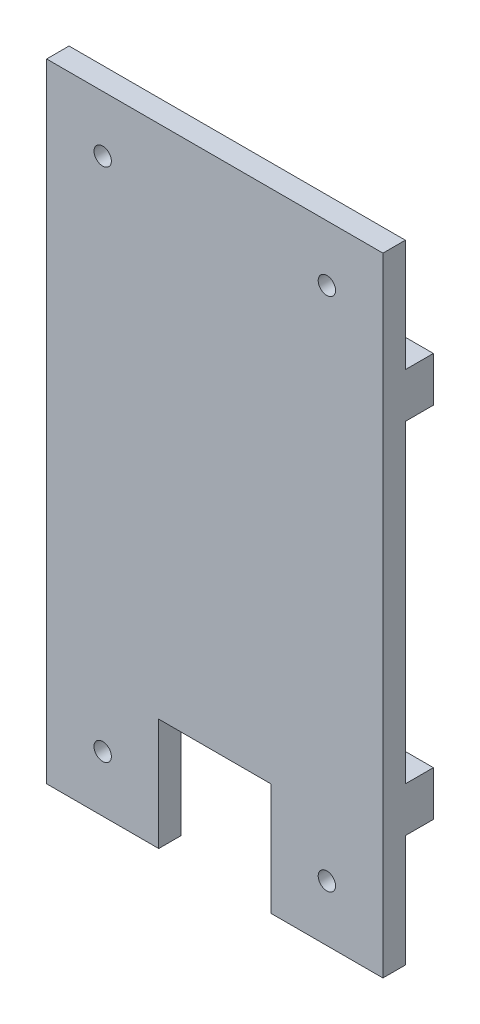
ISO-10303-21;
HEADER;
FILE_DESCRIPTION(('STEP AP214'),'2;1');
FILE_NAME('part.step','',(''),(''),'','','');
FILE_SCHEMA(('AUTOMOTIVE_DESIGN { 1 0 10303 214 1 1 1 1 }'));
ENDSEC;
DATA;
#1=APPLICATION_CONTEXT('core data for automotive mechanical design processes');
#2=APPLICATION_PROTOCOL_DEFINITION('international standard','automotive_design',2000,#1);
#3=PRODUCT_CONTEXT('',#1,'mechanical');
#4=PRODUCT('Part','Part','',(#3));
#5=PRODUCT_RELATED_PRODUCT_CATEGORY('part','',(#4));
#6=PRODUCT_DEFINITION_FORMATION('','',#4);
#7=PRODUCT_DEFINITION_CONTEXT('part definition',#1,'design');
#8=PRODUCT_DEFINITION('design','',#6,#7);
#9=PRODUCT_DEFINITION_SHAPE('','',#8);
#10=(LENGTH_UNIT() NAMED_UNIT(*) SI_UNIT(.MILLI.,.METRE.));
#11=(NAMED_UNIT(*) PLANE_ANGLE_UNIT() SI_UNIT($,.RADIAN.));
#12=(NAMED_UNIT(*) SI_UNIT($,.STERADIAN.) SOLID_ANGLE_UNIT());
#13=UNCERTAINTY_MEASURE_WITH_UNIT(LENGTH_MEASURE(1.E-05),#10,'distance_accuracy_value','');
#14=(GEOMETRIC_REPRESENTATION_CONTEXT(3) GLOBAL_UNCERTAINTY_ASSIGNED_CONTEXT((#13)) GLOBAL_UNIT_ASSIGNED_CONTEXT((#10,
#11,#12)) REPRESENTATION_CONTEXT('',''));
#15=CARTESIAN_POINT('',(0.,0.,0.));
#16=DIRECTION('',(0.,0.,1.));
#17=DIRECTION('',(1.,0.,0.));
#18=AXIS2_PLACEMENT_3D('',#15,#16,#17);
#19=CARTESIAN_POINT('',(0.,0.,0.));
#20=DIRECTION('',(0.,0.,1.));
#21=DIRECTION('',(1.,0.,0.));
#22=AXIS2_PLACEMENT_3D('',#19,#20,#21);
#23=PLANE('',#22);
#24=CARTESIAN_POINT('',(20.,-46.,0.));
#25=DIRECTION('',(0.,0.,1.));
#26=DIRECTION('',(1.,0.,0.));
#27=AXIS2_PLACEMENT_3D('',#24,#25,#26);
#28=CIRCLE('',#27,1.55);
#29=CARTESIAN_POINT('',(21.55,-46.,0.));
#30=VERTEX_POINT('',#29);
#31=EDGE_CURVE('E246',#30,#30,#28,.T.);
#32=ORIENTED_EDGE('',*,*,#31,.T.);
#33=EDGE_LOOP('',(#32));
#34=FACE_BOUND('',#33,.T.);
#35=DIRECTION('',(-1.,0.,0.));
#36=VECTOR('',#35,1.);
#37=CARTESIAN_POINT('',(0.,-36.,0.));
#38=LINE('',#37,#36);
#39=CARTESIAN_POINT('',(30.,-36.,0.));
#40=VERTEX_POINT('',#39);
#41=CARTESIAN_POINT('',(10.,-36.,0.));
#42=VERTEX_POINT('',#41);
#43=EDGE_CURVE('E167',#40,#42,#38,.T.);
#44=ORIENTED_EDGE('',*,*,#43,.F.);
#45=DIRECTION('',(0.,1.,0.));
#46=VECTOR('',#45,1.);
#47=CARTESIAN_POINT('',(30.,0.,0.));
#48=LINE('',#47,#46);
#49=CARTESIAN_POINT('',(30.,-56.,0.));
#50=VERTEX_POINT('',#49);
#51=EDGE_CURVE('E259',#50,#40,#48,.T.);
#52=ORIENTED_EDGE('',*,*,#51,.F.);
#53=DIRECTION('',(1.,0.,0.));
#54=VECTOR('',#53,1.);
#55=CARTESIAN_POINT('',(0.,-56.,0.));
#56=LINE('',#55,#54);
#57=CARTESIAN_POINT('',(10.,-56.,0.));
#58=VERTEX_POINT('',#57);
#59=EDGE_CURVE('E255',#58,#50,#56,.T.);
#60=ORIENTED_EDGE('',*,*,#59,.F.);
#61=DIRECTION('',(0.,1.,0.));
#62=VECTOR('',#61,1.);
#63=CARTESIAN_POINT('',(10.,0.,0.));
#64=LINE('',#63,#62);
#65=EDGE_CURVE('E252',#58,#42,#64,.T.);
#66=ORIENTED_EDGE('',*,*,#65,.T.);
#67=EDGE_LOOP('',(#44,#52,#60,#66));
#68=FACE_BOUND('',#67,.T.);
#69=ADVANCED_FACE('F32',(#34,#68),#23,.F.);
#70=CARTESIAN_POINT('',(-20.,-46.,0.));
#71=DIRECTION('',(0.,0.,1.));
#72=DIRECTION('',(1.,0.,0.));
#73=AXIS2_PLACEMENT_3D('',#70,#71,#72);
#74=CIRCLE('',#73,1.55);
#75=CARTESIAN_POINT('',(-18.45,-46.,0.));
#76=VERTEX_POINT('',#75);
#77=EDGE_CURVE('E249',#76,#76,#74,.T.);
#78=ORIENTED_EDGE('',*,*,#77,.T.);
#79=EDGE_LOOP('',(#78));
#80=FACE_BOUND('',#79,.T.);
#81=CARTESIAN_POINT('',(-10.,-36.,0.));
#82=VERTEX_POINT('',#81);
#83=CARTESIAN_POINT('',(-30.,-36.,0.));
#84=VERTEX_POINT('',#83);
#85=EDGE_CURVE('E169',#82,#84,#38,.T.);
#86=ORIENTED_EDGE('',*,*,#85,.F.);
#87=DIRECTION('',(0.,1.,0.));
#88=VECTOR('',#87,1.);
#89=CARTESIAN_POINT('',(-10.,0.,0.));
#90=LINE('',#89,#88);
#91=CARTESIAN_POINT('',(-10.,-56.,0.));
#92=VERTEX_POINT('',#91);
#93=EDGE_CURVE('E211',#92,#82,#90,.T.);
#94=ORIENTED_EDGE('',*,*,#93,.F.);
#95=CARTESIAN_POINT('',(-30.,-56.,0.));
#96=VERTEX_POINT('',#95);
#97=EDGE_CURVE('E258',#96,#92,#56,.T.);
#98=ORIENTED_EDGE('',*,*,#97,.F.);
#99=DIRECTION('',(0.,1.,0.));
#100=VECTOR('',#99,1.);
#101=CARTESIAN_POINT('',(-30.,0.,0.));
#102=LINE('',#101,#100);
#103=EDGE_CURVE('E264',#96,#84,#102,.T.);
#104=ORIENTED_EDGE('',*,*,#103,.T.);
#105=EDGE_LOOP('',(#86,#94,#98,#104));
#106=FACE_BOUND('',#105,.T.);
#107=ADVANCED_FACE('F329',(#80,#106),#23,.F.);
#108=CARTESIAN_POINT('',(30.,-28.,0.));
#109=VERTEX_POINT('',#108);
#110=CARTESIAN_POINT('',(30.,28.,0.));
#111=VERTEX_POINT('',#110);
#112=EDGE_CURVE('E55',#109,#111,#48,.T.);
#113=ORIENTED_EDGE('',*,*,#112,.F.);
#114=DIRECTION('',(-1.,0.,0.));
#115=VECTOR('',#114,1.);
#116=CARTESIAN_POINT('',(0.,-28.,0.));
#117=LINE('',#116,#115);
#118=CARTESIAN_POINT('',(-30.,-28.,0.));
#119=VERTEX_POINT('',#118);
#120=EDGE_CURVE('E151',#109,#119,#117,.T.);
#121=ORIENTED_EDGE('',*,*,#120,.T.);
#122=CARTESIAN_POINT('',(-30.,28.,0.));
#123=VERTEX_POINT('',#122);
#124=EDGE_CURVE('E267',#119,#123,#102,.T.);
#125=ORIENTED_EDGE('',*,*,#124,.T.);
#126=DIRECTION('',(-1.,0.,0.));
#127=VECTOR('',#126,1.);
#128=CARTESIAN_POINT('',(0.,28.,0.));
#129=LINE('',#128,#127);
#130=EDGE_CURVE('E152',#111,#123,#129,.T.);
#131=ORIENTED_EDGE('',*,*,#130,.F.);
#132=EDGE_LOOP('',(#113,#121,#125,#131));
#133=FACE_BOUND('',#132,.T.);
#134=ADVANCED_FACE('F307',(#133),#23,.F.);
#135=CARTESIAN_POINT('',(10.,0.,4.));
#136=DIRECTION('',(-1.,0.,0.));
#137=DIRECTION('',(0.,0.,1.));
#138=AXIS2_PLACEMENT_3D('',#135,#136,#137);
#139=PLANE('',#138);
#140=ORIENTED_EDGE('',*,*,#65,.F.);
#141=DIRECTION('',(0.,0.,-1.));
#142=VECTOR('',#141,1.);
#143=CARTESIAN_POINT('',(10.,-56.,4.));
#144=LINE('',#143,#142);
#145=CARTESIAN_POINT('',(10.,-56.,4.));
#146=VERTEX_POINT('',#145);
#147=EDGE_CURVE('E11',#146,#58,#144,.T.);
#148=ORIENTED_EDGE('',*,*,#147,.F.);
#149=DIRECTION('',(0.,1.,0.));
#150=VECTOR('',#149,1.);
#151=CARTESIAN_POINT('',(10.,0.,4.));
#152=LINE('',#151,#150);
#153=CARTESIAN_POINT('',(10.,-36.,4.));
#154=VERTEX_POINT('',#153);
#155=EDGE_CURVE('E220',#146,#154,#152,.T.);
#156=ORIENTED_EDGE('',*,*,#155,.T.);
#157=DIRECTION('',(0.,0.,-1.));
#158=VECTOR('',#157,1.);
#159=CARTESIAN_POINT('',(10.,-36.,4.));
#160=LINE('',#159,#158);
#161=EDGE_CURVE('E240',#154,#42,#160,.T.);
#162=ORIENTED_EDGE('',*,*,#161,.T.);
#163=EDGE_LOOP('',(#140,#148,#156,#162));
#164=FACE_BOUND('',#163,.T.);
#165=ADVANCED_FACE('F296',(#164),#139,.T.);
#166=CARTESIAN_POINT('',(0.,-56.,4.));
#167=DIRECTION('',(0.,1.,0.));
#168=DIRECTION('',(-1.,0.,0.));
#169=AXIS2_PLACEMENT_3D('',#166,#167,#168);
#170=PLANE('',#169);
#171=ORIENTED_EDGE('',*,*,#59,.T.);
#172=DIRECTION('',(0.,0.,-1.));
#173=VECTOR('',#172,1.);
#174=CARTESIAN_POINT('',(30.,-56.,4.));
#175=LINE('',#174,#173);
#176=CARTESIAN_POINT('',(30.,-56.,4.));
#177=VERTEX_POINT('',#176);
#178=EDGE_CURVE('E40',#177,#50,#175,.T.);
#179=ORIENTED_EDGE('',*,*,#178,.F.);
#180=DIRECTION('',(1.,0.,0.));
#181=VECTOR('',#180,1.);
#182=CARTESIAN_POINT('',(0.,-56.,4.));
#183=LINE('',#182,#181);
#184=EDGE_CURVE('E223',#146,#177,#183,.T.);
#185=ORIENTED_EDGE('',*,*,#184,.F.);
#186=ORIENTED_EDGE('',*,*,#147,.T.);
#187=EDGE_LOOP('',(#171,#179,#185,#186));
#188=FACE_BOUND('',#187,.T.);
#189=ADVANCED_FACE('F291',(#188),#170,.F.);
#190=CARTESIAN_POINT('',(30.,0.,4.));
#191=DIRECTION('',(-1.,0.,0.));
#192=DIRECTION('',(0.,0.,1.));
#193=AXIS2_PLACEMENT_3D('',#190,#191,#192);
#194=PLANE('',#193);
#195=ORIENTED_EDGE('',*,*,#51,.T.);
#196=DIRECTION('',(0.,0.,1.));
#197=VECTOR('',#196,1.);
#198=CARTESIAN_POINT('',(30.,-36.,-5.));
#199=LINE('',#198,#197);
#200=CARTESIAN_POINT('',(30.,-36.,-5.));
#201=VERTEX_POINT('',#200);
#202=EDGE_CURVE('E153',#201,#40,#199,.T.);
#203=ORIENTED_EDGE('',*,*,#202,.F.);
#204=DIRECTION('',(0.,-1.,0.));
#205=VECTOR('',#204,1.);
#206=CARTESIAN_POINT('',(30.,0.,-5.));
#207=LINE('',#206,#205);
#208=CARTESIAN_POINT('',(30.,-28.,-5.));
#209=VERTEX_POINT('',#208);
#210=EDGE_CURVE('E156',#209,#201,#207,.T.);
#211=ORIENTED_EDGE('',*,*,#210,.F.);
#212=DIRECTION('',(0.,0.,1.));
#213=VECTOR('',#212,1.);
#214=CARTESIAN_POINT('',(30.,-28.,-5.));
#215=LINE('',#214,#213);
#216=EDGE_CURVE('E145',#209,#109,#215,.T.);
#217=ORIENTED_EDGE('',*,*,#216,.T.);
#218=ORIENTED_EDGE('',*,*,#112,.T.);
#219=DIRECTION('',(0.,0.,1.));
#220=VECTOR('',#219,1.);
#221=CARTESIAN_POINT('',(30.,28.,-5.));
#222=LINE('',#221,#220);
#223=CARTESIAN_POINT('',(30.,28.,-5.));
#224=VERTEX_POINT('',#223);
#225=EDGE_CURVE('E203',#224,#111,#222,.T.);
#226=ORIENTED_EDGE('',*,*,#225,.F.);
#227=DIRECTION('',(0.,-1.,0.));
#228=VECTOR('',#227,1.);
#229=CARTESIAN_POINT('',(30.,0.,-5.));
#230=LINE('',#229,#228);
#231=CARTESIAN_POINT('',(30.,36.,-5.));
#232=VERTEX_POINT('',#231);
#233=EDGE_CURVE('E181',#232,#224,#230,.T.);
#234=ORIENTED_EDGE('',*,*,#233,.F.);
#235=DIRECTION('',(0.,0.,1.));
#236=VECTOR('',#235,1.);
#237=CARTESIAN_POINT('',(30.,36.,-5.));
#238=LINE('',#237,#236);
#239=CARTESIAN_POINT('',(30.,36.,0.));
#240=VERTEX_POINT('',#239);
#241=EDGE_CURVE('E192',#232,#240,#238,.T.);
#242=ORIENTED_EDGE('',*,*,#241,.T.);
#243=CARTESIAN_POINT('',(30.,56.,0.));
#244=VERTEX_POINT('',#243);
#245=EDGE_CURVE('E47',#240,#244,#48,.T.);
#246=ORIENTED_EDGE('',*,*,#245,.T.);
#247=DIRECTION('',(0.,0.,-1.));
#248=VECTOR('',#247,1.);
#249=CARTESIAN_POINT('',(30.,56.,4.));
#250=LINE('',#249,#248);
#251=CARTESIAN_POINT('',(30.,56.,4.));
#252=VERTEX_POINT('',#251);
#253=EDGE_CURVE('E283',#252,#244,#250,.T.);
#254=ORIENTED_EDGE('',*,*,#253,.F.);
#255=DIRECTION('',(0.,1.,0.));
#256=VECTOR('',#255,1.);
#257=CARTESIAN_POINT('',(30.,0.,4.));
#258=LINE('',#257,#256);
#259=EDGE_CURVE('E226',#177,#252,#258,.T.);
#260=ORIENTED_EDGE('',*,*,#259,.F.);
#261=ORIENTED_EDGE('',*,*,#178,.T.);
#262=EDGE_LOOP('',(#195,#203,#211,#217,#218,#226,#234,#242,#246,#254,#260,#261));
#263=FACE_BOUND('',#262,.T.);
#264=ADVANCED_FACE('F158',(#263),#194,.F.);
#265=CARTESIAN_POINT('',(0.,56.,4.));
#266=DIRECTION('',(0.,1.,0.));
#267=DIRECTION('',(0.,0.,1.));
#268=AXIS2_PLACEMENT_3D('',#265,#266,#267);
#269=PLANE('',#268);
#270=DIRECTION('',(1.,0.,0.));
#271=VECTOR('',#270,1.);
#272=CARTESIAN_POINT('',(0.,56.,0.));
#273=LINE('',#272,#271);
#274=CARTESIAN_POINT('',(-30.,56.,0.));
#275=VERTEX_POINT('',#274);
#276=EDGE_CURVE('E261',#275,#244,#273,.T.);
#277=ORIENTED_EDGE('',*,*,#276,.F.);
#278=DIRECTION('',(0.,0.,-1.));
#279=VECTOR('',#278,1.);
#280=CARTESIAN_POINT('',(-30.,56.,4.));
#281=LINE('',#280,#279);
#282=CARTESIAN_POINT('',(-30.,56.,4.));
#283=VERTEX_POINT('',#282);
#284=EDGE_CURVE('E280',#283,#275,#281,.T.);
#285=ORIENTED_EDGE('',*,*,#284,.F.);
#286=DIRECTION('',(1.,0.,0.));
#287=VECTOR('',#286,1.);
#288=CARTESIAN_POINT('',(0.,56.,4.));
#289=LINE('',#288,#287);
#290=EDGE_CURVE('E229',#283,#252,#289,.T.);
#291=ORIENTED_EDGE('',*,*,#290,.T.);
#292=ORIENTED_EDGE('',*,*,#253,.T.);
#293=EDGE_LOOP('',(#277,#285,#291,#292));
#294=FACE_BOUND('',#293,.T.);
#295=ADVANCED_FACE('F312',(#294),#269,.T.);
#296=CARTESIAN_POINT('',(-30.,0.,4.));
#297=DIRECTION('',(-1.,0.,0.));
#298=DIRECTION('',(0.,-1.,0.));
#299=AXIS2_PLACEMENT_3D('',#296,#297,#298);
#300=PLANE('',#299);
#301=ORIENTED_EDGE('',*,*,#103,.F.);
#302=DIRECTION('',(0.,0.,-1.));
#303=VECTOR('',#302,1.);
#304=CARTESIAN_POINT('',(-30.,-56.,4.));
#305=LINE('',#304,#303);
#306=CARTESIAN_POINT('',(-30.,-56.,4.));
#307=VERTEX_POINT('',#306);
#308=EDGE_CURVE('E278',#307,#96,#305,.T.);
#309=ORIENTED_EDGE('',*,*,#308,.F.);
#310=DIRECTION('',(0.,1.,0.));
#311=VECTOR('',#310,1.);
#312=CARTESIAN_POINT('',(-30.,0.,4.));
#313=LINE('',#312,#311);
#314=EDGE_CURVE('E232',#307,#283,#313,.T.);
#315=ORIENTED_EDGE('',*,*,#314,.T.);
#316=ORIENTED_EDGE('',*,*,#284,.T.);
#317=CARTESIAN_POINT('',(-30.,36.,0.));
#318=VERTEX_POINT('',#317);
#319=EDGE_CURVE('E263',#318,#275,#102,.T.);
#320=ORIENTED_EDGE('',*,*,#319,.F.);
#321=DIRECTION('',(0.,0.,1.));
#322=VECTOR('',#321,1.);
#323=CARTESIAN_POINT('',(-30.,36.,-5.));
#324=LINE('',#323,#322);
#325=CARTESIAN_POINT('',(-30.,36.,-5.));
#326=VERTEX_POINT('',#325);
#327=EDGE_CURVE('E197',#326,#318,#324,.T.);
#328=ORIENTED_EDGE('',*,*,#327,.F.);
#329=DIRECTION('',(0.,1.,0.));
#330=VECTOR('',#329,1.);
#331=CARTESIAN_POINT('',(-30.,0.,-5.));
#332=LINE('',#331,#330);
#333=CARTESIAN_POINT('',(-30.,28.,-5.));
#334=VERTEX_POINT('',#333);
#335=EDGE_CURVE('E187',#334,#326,#332,.T.);
#336=ORIENTED_EDGE('',*,*,#335,.F.);
#337=DIRECTION('',(0.,0.,1.));
#338=VECTOR('',#337,1.);
#339=CARTESIAN_POINT('',(-30.,28.,-5.));
#340=LINE('',#339,#338);
#341=EDGE_CURVE('E200',#334,#123,#340,.T.);
#342=ORIENTED_EDGE('',*,*,#341,.T.);
#343=ORIENTED_EDGE('',*,*,#124,.F.);
#344=DIRECTION('',(0.,0.,1.));
#345=VECTOR('',#344,1.);
#346=CARTESIAN_POINT('',(-30.,-28.,-5.));
#347=LINE('',#346,#345);
#348=CARTESIAN_POINT('',(-30.,-28.,-5.));
#349=VERTEX_POINT('',#348);
#350=EDGE_CURVE('E174',#349,#119,#347,.T.);
#351=ORIENTED_EDGE('',*,*,#350,.F.);
#352=DIRECTION('',(0.,1.,0.));
#353=VECTOR('',#352,1.);
#354=CARTESIAN_POINT('',(-30.,0.,-5.));
#355=LINE('',#354,#353);
#356=CARTESIAN_POINT('',(-30.,-36.,-5.));
#357=VERTEX_POINT('',#356);
#358=EDGE_CURVE('E165',#357,#349,#355,.T.);
#359=ORIENTED_EDGE('',*,*,#358,.F.);
#360=DIRECTION('',(0.,0.,1.));
#361=VECTOR('',#360,1.);
#362=CARTESIAN_POINT('',(-30.,-36.,-5.));
#363=LINE('',#362,#361);
#364=EDGE_CURVE('E177',#357,#84,#363,.T.);
#365=ORIENTED_EDGE('',*,*,#364,.T.);
#366=EDGE_LOOP('',(#301,#309,#315,#316,#320,#328,#336,#342,#343,#351,#359,#365));
#367=FACE_BOUND('',#366,.T.);
#368=ADVANCED_FACE('F304',(#367),#300,.T.);
#369=ORIENTED_EDGE('',*,*,#97,.T.);
#370=DIRECTION('',(0.,0.,-1.));
#371=VECTOR('',#370,1.);
#372=CARTESIAN_POINT('',(-10.,-56.,4.));
#373=LINE('',#372,#371);
#374=CARTESIAN_POINT('',(-10.,-56.,4.));
#375=VERTEX_POINT('',#374);
#376=EDGE_CURVE('E275',#375,#92,#373,.T.);
#377=ORIENTED_EDGE('',*,*,#376,.F.);
#378=EDGE_CURVE('E227',#307,#375,#183,.T.);
#379=ORIENTED_EDGE('',*,*,#378,.F.);
#380=ORIENTED_EDGE('',*,*,#308,.T.);
#381=EDGE_LOOP('',(#369,#377,#379,#380));
#382=FACE_BOUND('',#381,.T.);
#383=ADVANCED_FACE('F331',(#382),#170,.F.);
#384=CARTESIAN_POINT('',(-10.,0.,4.));
#385=DIRECTION('',(-1.,0.,0.));
#386=DIRECTION('',(0.,0.,1.));
#387=AXIS2_PLACEMENT_3D('',#384,#385,#386);
#388=PLANE('',#387);
#389=ORIENTED_EDGE('',*,*,#93,.T.);
#390=DIRECTION('',(0.,0.,-1.));
#391=VECTOR('',#390,1.);
#392=CARTESIAN_POINT('',(-10.,-36.,4.));
#393=LINE('',#392,#391);
#394=CARTESIAN_POINT('',(-10.,-36.,4.));
#395=VERTEX_POINT('',#394);
#396=EDGE_CURVE('E272',#395,#82,#393,.T.);
#397=ORIENTED_EDGE('',*,*,#396,.F.);
#398=DIRECTION('',(0.,1.,0.));
#399=VECTOR('',#398,1.);
#400=CARTESIAN_POINT('',(-10.,0.,4.));
#401=LINE('',#400,#399);
#402=EDGE_CURVE('E235',#375,#395,#401,.T.);
#403=ORIENTED_EDGE('',*,*,#402,.F.);
#404=ORIENTED_EDGE('',*,*,#376,.T.);
#405=EDGE_LOOP('',(#389,#397,#403,#404));
#406=FACE_BOUND('',#405,.T.);
#407=ADVANCED_FACE('F325',(#406),#388,.F.);
#408=CARTESIAN_POINT('',(-20.,-46.,4.));
#409=DIRECTION('',(0.,0.,-1.));
#410=DIRECTION('',(-1.,0.,0.));
#411=AXIS2_PLACEMENT_3D('',#408,#409,#410);
#412=CYLINDRICAL_SURFACE('',#411,1.55);
#413=CARTESIAN_POINT('',(-20.,-46.,4.));
#414=DIRECTION('',(0.,0.,1.));
#415=DIRECTION('',(1.,0.,0.));
#416=AXIS2_PLACEMENT_3D('',#413,#414,#415);
#417=CIRCLE('',#416,1.55);
#418=CARTESIAN_POINT('',(-18.45,-46.,4.));
#419=VERTEX_POINT('',#418);
#420=EDGE_CURVE('E217',#419,#419,#417,.T.);
#421=ORIENTED_EDGE('',*,*,#420,.T.);
#422=EDGE_LOOP('',(#421));
#423=FACE_BOUND('',#422,.T.);
#424=ORIENTED_EDGE('',*,*,#77,.F.);
#425=EDGE_LOOP('',(#424));
#426=FACE_BOUND('',#425,.T.);
#427=ADVANCED_FACE('F338',(#423,#426),#412,.F.);
#428=CARTESIAN_POINT('',(20.,-46.,4.));
#429=DIRECTION('',(0.,0.,-1.));
#430=DIRECTION('',(-1.,0.,0.));
#431=AXIS2_PLACEMENT_3D('',#428,#429,#430);
#432=CYLINDRICAL_SURFACE('',#431,1.55);
#433=CARTESIAN_POINT('',(20.,-46.,4.));
#434=DIRECTION('',(0.,0.,1.));
#435=DIRECTION('',(1.,0.,0.));
#436=AXIS2_PLACEMENT_3D('',#433,#434,#435);
#437=CIRCLE('',#436,1.55);
#438=CARTESIAN_POINT('',(21.55,-46.,4.));
#439=VERTEX_POINT('',#438);
#440=EDGE_CURVE('E214',#439,#439,#437,.T.);
#441=ORIENTED_EDGE('',*,*,#440,.T.);
#442=EDGE_LOOP('',(#441));
#443=FACE_BOUND('',#442,.T.);
#444=ORIENTED_EDGE('',*,*,#31,.F.);
#445=EDGE_LOOP('',(#444));
#446=FACE_BOUND('',#445,.T.);
#447=ADVANCED_FACE('F375',(#443,#446),#432,.F.);
#448=CARTESIAN_POINT('',(-20.,46.,4.));
#449=DIRECTION('',(0.,0.,-1.));
#450=DIRECTION('',(-1.,0.,0.));
#451=AXIS2_PLACEMENT_3D('',#448,#449,#450);
#452=CYLINDRICAL_SURFACE('',#451,1.55);
#453=CARTESIAN_POINT('',(-20.,46.,4.));
#454=DIRECTION('',(0.,0.,1.));
#455=DIRECTION('',(1.,0.,0.));
#456=AXIS2_PLACEMENT_3D('',#453,#454,#455);
#457=CIRCLE('',#456,1.55);
#458=CARTESIAN_POINT('',(-18.45,46.,4.));
#459=VERTEX_POINT('',#458);
#460=EDGE_CURVE('E210',#459,#459,#457,.T.);
#461=ORIENTED_EDGE('',*,*,#460,.T.);
#462=EDGE_LOOP('',(#461));
#463=FACE_BOUND('',#462,.T.);
#464=CARTESIAN_POINT('',(-20.,46.,0.));
#465=DIRECTION('',(0.,0.,1.));
#466=DIRECTION('',(1.,0.,0.));
#467=AXIS2_PLACEMENT_3D('',#464,#465,#466);
#468=CIRCLE('',#467,1.55);
#469=CARTESIAN_POINT('',(-18.45,46.,0.));
#470=VERTEX_POINT('',#469);
#471=EDGE_CURVE('E243',#470,#470,#468,.T.);
#472=ORIENTED_EDGE('',*,*,#471,.F.);
#473=EDGE_LOOP('',(#472));
#474=FACE_BOUND('',#473,.T.);
#475=ADVANCED_FACE('F378',(#463,#474),#452,.F.);
#476=CARTESIAN_POINT('',(20.,46.,4.));
#477=DIRECTION('',(0.,0.,-1.));
#478=DIRECTION('',(-1.,0.,0.));
#479=AXIS2_PLACEMENT_3D('',#476,#477,#478);
#480=CYLINDRICAL_SURFACE('',#479,1.55);
#481=CARTESIAN_POINT('',(20.,46.,4.));
#482=DIRECTION('',(0.,0.,1.));
#483=DIRECTION('',(1.,0.,0.));
#484=AXIS2_PLACEMENT_3D('',#481,#482,#483);
#485=CIRCLE('',#484,1.55);
#486=CARTESIAN_POINT('',(21.55,46.,4.));
#487=VERTEX_POINT('',#486);
#488=EDGE_CURVE('E207',#487,#487,#485,.T.);
#489=ORIENTED_EDGE('',*,*,#488,.T.);
#490=EDGE_LOOP('',(#489));
#491=FACE_BOUND('',#490,.T.);
#492=CARTESIAN_POINT('',(20.,46.,0.));
#493=DIRECTION('',(0.,0.,1.));
#494=DIRECTION('',(1.,0.,0.));
#495=AXIS2_PLACEMENT_3D('',#492,#493,#494);
#496=CIRCLE('',#495,1.55);
#497=CARTESIAN_POINT('',(21.55,46.,0.));
#498=VERTEX_POINT('',#497);
#499=EDGE_CURVE('E206',#498,#498,#496,.T.);
#500=ORIENTED_EDGE('',*,*,#499,.F.);
#501=EDGE_LOOP('',(#500));
#502=FACE_BOUND('',#501,.T.);
#503=ADVANCED_FACE('F34',(#491,#502),#480,.F.);
#504=CARTESIAN_POINT('',(0.,-36.,4.));
#505=DIRECTION('',(0.,1.,0.));
#506=DIRECTION('',(0.,0.,1.));
#507=AXIS2_PLACEMENT_3D('',#504,#505,#506);
#508=PLANE('',#507);
#509=ORIENTED_EDGE('',*,*,#396,.T.);
#510=ORIENTED_EDGE('',*,*,#85,.T.);
#511=ORIENTED_EDGE('',*,*,#364,.F.);
#512=DIRECTION('',(-1.,0.,0.));
#513=VECTOR('',#512,1.);
#514=CARTESIAN_POINT('',(0.,-36.,-5.));
#515=LINE('',#514,#513);
#516=EDGE_CURVE('E161',#201,#357,#515,.T.);
#517=ORIENTED_EDGE('',*,*,#516,.F.);
#518=ORIENTED_EDGE('',*,*,#202,.T.);
#519=ORIENTED_EDGE('',*,*,#43,.T.);
#520=ORIENTED_EDGE('',*,*,#161,.F.);
#521=DIRECTION('',(1.,0.,0.));
#522=VECTOR('',#521,1.);
#523=CARTESIAN_POINT('',(0.,-36.,4.));
#524=LINE('',#523,#522);
#525=EDGE_CURVE('E238',#395,#154,#524,.T.);
#526=ORIENTED_EDGE('',*,*,#525,.F.);
#527=EDGE_LOOP('',(#509,#510,#511,#517,#518,#519,#520,#526));
#528=FACE_BOUND('',#527,.T.);
#529=ADVANCED_FACE('F300',(#528),#508,.F.);
#530=CARTESIAN_POINT('',(0.,0.,4.));
#531=DIRECTION('',(0.,0.,1.));
#532=DIRECTION('',(1.,0.,0.));
#533=AXIS2_PLACEMENT_3D('',#530,#531,#532);
#534=PLANE('',#533);
#535=ORIENTED_EDGE('',*,*,#488,.F.);
#536=EDGE_LOOP('',(#535));
#537=FACE_BOUND('',#536,.T.);
#538=ORIENTED_EDGE('',*,*,#460,.F.);
#539=EDGE_LOOP('',(#538));
#540=FACE_BOUND('',#539,.T.);
#541=ORIENTED_EDGE('',*,*,#440,.F.);
#542=EDGE_LOOP('',(#541));
#543=FACE_BOUND('',#542,.T.);
#544=ORIENTED_EDGE('',*,*,#420,.F.);
#545=EDGE_LOOP('',(#544));
#546=FACE_BOUND('',#545,.T.);
#547=ORIENTED_EDGE('',*,*,#155,.F.);
#548=ORIENTED_EDGE('',*,*,#184,.T.);
#549=ORIENTED_EDGE('',*,*,#259,.T.);
#550=ORIENTED_EDGE('',*,*,#290,.F.);
#551=ORIENTED_EDGE('',*,*,#314,.F.);
#552=ORIENTED_EDGE('',*,*,#378,.T.);
#553=ORIENTED_EDGE('',*,*,#402,.T.);
#554=ORIENTED_EDGE('',*,*,#525,.T.);
#555=EDGE_LOOP('',(#547,#548,#549,#550,#551,#552,#553,#554));
#556=FACE_BOUND('',#555,.T.);
#557=ADVANCED_FACE('F319',(#537,#540,#543,#546,#556),#534,.T.);
#558=ORIENTED_EDGE('',*,*,#499,.T.);
#559=EDGE_LOOP('',(#558));
#560=FACE_BOUND('',#559,.T.);
#561=ORIENTED_EDGE('',*,*,#471,.T.);
#562=EDGE_LOOP('',(#561));
#563=FACE_BOUND('',#562,.T.);
#564=ORIENTED_EDGE('',*,*,#245,.F.);
#565=DIRECTION('',(-1.,0.,0.));
#566=VECTOR('',#565,1.);
#567=CARTESIAN_POINT('',(0.,36.,0.));
#568=LINE('',#567,#566);
#569=EDGE_CURVE('E185',#240,#318,#568,.T.);
#570=ORIENTED_EDGE('',*,*,#569,.T.);
#571=ORIENTED_EDGE('',*,*,#319,.T.);
#572=ORIENTED_EDGE('',*,*,#276,.T.);
#573=EDGE_LOOP('',(#564,#570,#571,#572));
#574=FACE_BOUND('',#573,.T.);
#575=ADVANCED_FACE('F314',(#560,#563,#574),#23,.F.);
#576=CARTESIAN_POINT('',(0.,28.,-5.));
#577=DIRECTION('',(0.,1.,0.));
#578=DIRECTION('',(0.,0.,1.));
#579=AXIS2_PLACEMENT_3D('',#576,#577,#578);
#580=PLANE('',#579);
#581=ORIENTED_EDGE('',*,*,#130,.T.);
#582=ORIENTED_EDGE('',*,*,#341,.F.);
#583=DIRECTION('',(-1.,0.,0.));
#584=VECTOR('',#583,1.);
#585=CARTESIAN_POINT('',(0.,28.,-5.));
#586=LINE('',#585,#584);
#587=EDGE_CURVE('E184',#224,#334,#586,.T.);
#588=ORIENTED_EDGE('',*,*,#587,.F.);
#589=ORIENTED_EDGE('',*,*,#225,.T.);
#590=EDGE_LOOP('',(#581,#582,#588,#589));
#591=FACE_BOUND('',#590,.T.);
#592=ADVANCED_FACE('F352',(#591),#580,.F.);
#593=CARTESIAN_POINT('',(0.,36.,-5.));
#594=DIRECTION('',(0.,1.,0.));
#595=DIRECTION('',(-1.,0.,0.));
#596=AXIS2_PLACEMENT_3D('',#593,#594,#595);
#597=PLANE('',#596);
#598=ORIENTED_EDGE('',*,*,#569,.F.);
#599=ORIENTED_EDGE('',*,*,#241,.F.);
#600=DIRECTION('',(-1.,0.,0.));
#601=VECTOR('',#600,1.);
#602=CARTESIAN_POINT('',(0.,36.,-5.));
#603=LINE('',#602,#601);
#604=EDGE_CURVE('E189',#232,#326,#603,.T.);
#605=ORIENTED_EDGE('',*,*,#604,.T.);
#606=ORIENTED_EDGE('',*,*,#327,.T.);
#607=EDGE_LOOP('',(#598,#599,#605,#606));
#608=FACE_BOUND('',#607,.T.);
#609=ADVANCED_FACE('F358',(#608),#597,.T.);
#610=CARTESIAN_POINT('',(0.,0.,-5.));
#611=DIRECTION('',(0.,0.,-1.));
#612=DIRECTION('',(-1.,0.,0.));
#613=AXIS2_PLACEMENT_3D('',#610,#611,#612);
#614=PLANE('',#613);
#615=ORIENTED_EDGE('',*,*,#233,.T.);
#616=ORIENTED_EDGE('',*,*,#587,.T.);
#617=ORIENTED_EDGE('',*,*,#335,.T.);
#618=ORIENTED_EDGE('',*,*,#604,.F.);
#619=EDGE_LOOP('',(#615,#616,#617,#618));
#620=FACE_BOUND('',#619,.T.);
#621=ADVANCED_FACE('F496',(#620),#614,.T.);
#622=CARTESIAN_POINT('',(0.,-28.,-5.));
#623=DIRECTION('',(0.,1.,0.));
#624=DIRECTION('',(0.,0.,1.));
#625=AXIS2_PLACEMENT_3D('',#622,#623,#624);
#626=PLANE('',#625);
#627=ORIENTED_EDGE('',*,*,#120,.F.);
#628=ORIENTED_EDGE('',*,*,#216,.F.);
#629=DIRECTION('',(-1.,0.,0.));
#630=VECTOR('',#629,1.);
#631=CARTESIAN_POINT('',(0.,-28.,-5.));
#632=LINE('',#631,#630);
#633=EDGE_CURVE('E149',#209,#349,#632,.T.);
#634=ORIENTED_EDGE('',*,*,#633,.T.);
#635=ORIENTED_EDGE('',*,*,#350,.T.);
#636=EDGE_LOOP('',(#627,#628,#634,#635));
#637=FACE_BOUND('',#636,.T.);
#638=ADVANCED_FACE('F147',(#637),#626,.T.);
#639=CARTESIAN_POINT('',(0.,0.,-5.));
#640=DIRECTION('',(0.,0.,-1.));
#641=DIRECTION('',(-1.,0.,0.));
#642=AXIS2_PLACEMENT_3D('',#639,#640,#641);
#643=PLANE('',#642);
#644=ORIENTED_EDGE('',*,*,#633,.F.);
#645=ORIENTED_EDGE('',*,*,#210,.T.);
#646=ORIENTED_EDGE('',*,*,#516,.T.);
#647=ORIENTED_EDGE('',*,*,#358,.T.);
#648=EDGE_LOOP('',(#644,#645,#646,#647));
#649=FACE_BOUND('',#648,.T.);
#650=ADVANCED_FACE('F163',(#649),#643,.T.);
#651=CLOSED_SHELL('',(#69,#107,#134,#165,#189,#264,#295,#368,#383,#407,#427,#447,#475,#503,#529,
#557,#575,#592,#609,#621,#638,#650));
#652=MANIFOLD_SOLID_BREP('B2',#651);
#653=ADVANCED_BREP_SHAPE_REPRESENTATION('',(#18,#652),#14);
#654=SHAPE_DEFINITION_REPRESENTATION(#9,#653);
ENDSEC;
END-ISO-10303-21;
